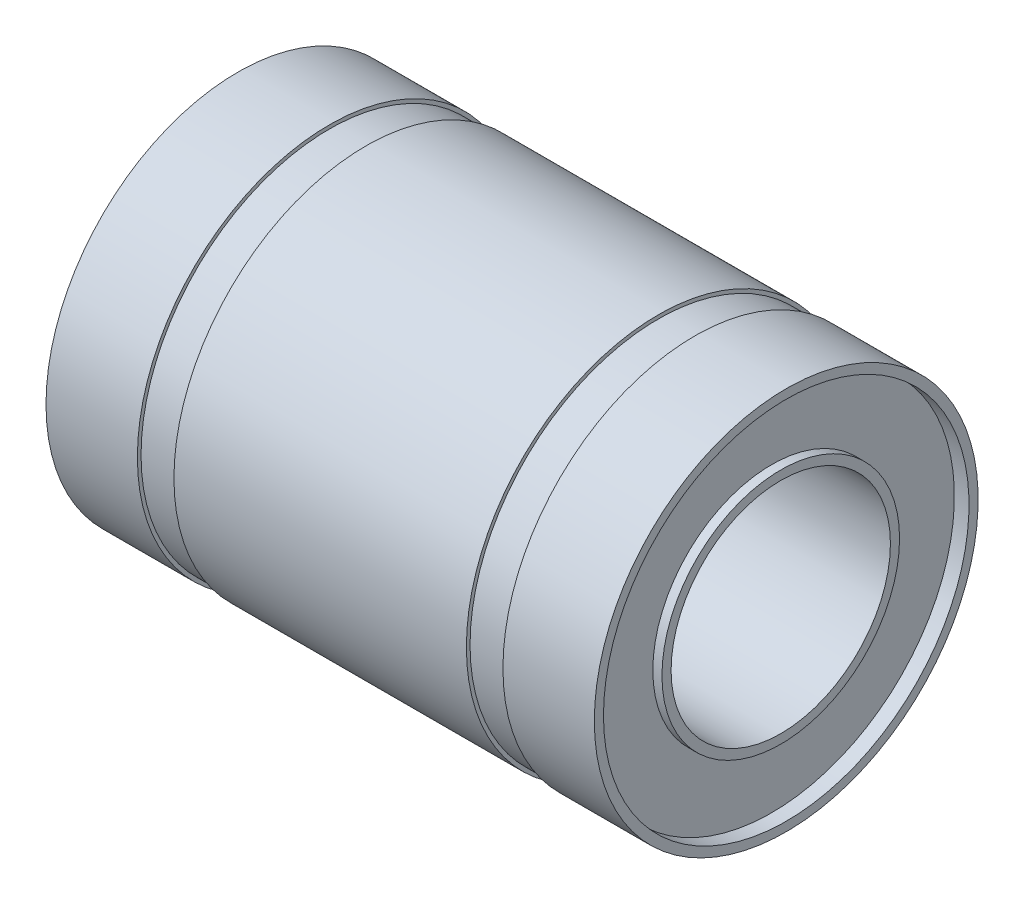
ISO-10303-21;
HEADER;
FILE_DESCRIPTION(('STEP AP214'),'2;1');
FILE_NAME('part.step','',(''),(''),'','','');
FILE_SCHEMA(('AUTOMOTIVE_DESIGN { 1 0 10303 214 1 1 1 1 }'));
ENDSEC;
DATA;
#1=APPLICATION_CONTEXT('core data for automotive mechanical design processes');
#2=APPLICATION_PROTOCOL_DEFINITION('international standard','automotive_design',2000,#1);
#3=PRODUCT_CONTEXT('',#1,'mechanical');
#4=PRODUCT('Part','Part','',(#3));
#5=PRODUCT_RELATED_PRODUCT_CATEGORY('part','',(#4));
#6=PRODUCT_DEFINITION_FORMATION('','',#4);
#7=PRODUCT_DEFINITION_CONTEXT('part definition',#1,'design');
#8=PRODUCT_DEFINITION('design','',#6,#7);
#9=PRODUCT_DEFINITION_SHAPE('','',#8);
#10=(LENGTH_UNIT() NAMED_UNIT(*) SI_UNIT(.MILLI.,.METRE.));
#11=(NAMED_UNIT(*) PLANE_ANGLE_UNIT() SI_UNIT($,.RADIAN.));
#12=(NAMED_UNIT(*) SI_UNIT($,.STERADIAN.) SOLID_ANGLE_UNIT());
#13=UNCERTAINTY_MEASURE_WITH_UNIT(LENGTH_MEASURE(1.E-05),#10,'distance_accuracy_value','');
#14=(GEOMETRIC_REPRESENTATION_CONTEXT(3) GLOBAL_UNCERTAINTY_ASSIGNED_CONTEXT((#13)) GLOBAL_UNIT_ASSIGNED_CONTEXT((#10,
#11,#12)) REPRESENTATION_CONTEXT('',''));
#15=CARTESIAN_POINT('',(0.,0.,0.));
#16=DIRECTION('',(0.,0.,1.));
#17=DIRECTION('',(1.,0.,0.));
#18=AXIS2_PLACEMENT_3D('',#15,#16,#17);
#19=CARTESIAN_POINT('',(8.00000000000001,10.5,0.));
#20=DIRECTION('',(-1.,0.,0.));
#21=DIRECTION('',(0.,0.,1.));
#22=AXIS2_PLACEMENT_3D('',#19,#20,#21);
#23=PLANE('',#22);
#24=CARTESIAN_POINT('',(8.00000000000001,0.,0.));
#25=DIRECTION('',(-1.,0.,0.));
#26=DIRECTION('',(0.,0.,1.));
#27=AXIS2_PLACEMENT_3D('',#24,#25,#26);
#28=CIRCLE('',#27,10.5);
#29=CARTESIAN_POINT('',(8.00000000000001,0.,10.5));
#30=VERTEX_POINT('',#29);
#31=EDGE_CURVE('E10',#30,#30,#28,.T.);
#32=ORIENTED_EDGE('',*,*,#31,.F.);
#33=EDGE_LOOP('',(#32));
#34=FACE_BOUND('',#33,.T.);
#35=CARTESIAN_POINT('',(8.00000000000001,0.,0.));
#36=DIRECTION('',(-1.,0.,0.));
#37=DIRECTION('',(0.,0.,1.));
#38=AXIS2_PLACEMENT_3D('',#35,#36,#37);
#39=CIRCLE('',#38,10.3);
#40=CARTESIAN_POINT('',(8.00000000000001,0.,10.3));
#41=VERTEX_POINT('',#40);
#42=EDGE_CURVE('E97',#41,#41,#39,.T.);
#43=ORIENTED_EDGE('',*,*,#42,.T.);
#44=EDGE_LOOP('',(#43));
#45=FACE_BOUND('',#44,.T.);
#46=ADVANCED_FACE('F33',(#34,#45),#23,.F.);
#47=CARTESIAN_POINT('',(0.,0.,0.));
#48=DIRECTION('',(-1.,0.,0.));
#49=DIRECTION('',(0.,0.,1.));
#50=AXIS2_PLACEMENT_3D('',#47,#48,#49);
#51=CYLINDRICAL_SURFACE('',#50,10.5);
#52=CARTESIAN_POINT('',(-7.99999999999999,0.,0.));
#53=DIRECTION('',(-1.,0.,0.));
#54=DIRECTION('',(0.,0.,1.));
#55=AXIS2_PLACEMENT_3D('',#52,#53,#54);
#56=CIRCLE('',#55,10.5);
#57=CARTESIAN_POINT('',(-7.99999999999999,0.,10.5));
#58=VERTEX_POINT('',#57);
#59=EDGE_CURVE('E39',#58,#58,#56,.T.);
#60=ORIENTED_EDGE('',*,*,#59,.F.);
#61=EDGE_LOOP('',(#60));
#62=FACE_BOUND('',#61,.T.);
#63=ORIENTED_EDGE('',*,*,#31,.T.);
#64=EDGE_LOOP('',(#63));
#65=FACE_BOUND('',#64,.T.);
#66=ADVANCED_FACE('F206',(#62,#65),#51,.T.);
#67=CARTESIAN_POINT('',(-7.99999999999999,10.5,0.));
#68=DIRECTION('',(1.,0.,0.));
#69=DIRECTION('',(0.,0.,-1.));
#70=AXIS2_PLACEMENT_3D('',#67,#68,#69);
#71=PLANE('',#70);
#72=CARTESIAN_POINT('',(-7.99999999999999,0.,0.));
#73=DIRECTION('',(-1.,0.,0.));
#74=DIRECTION('',(0.,0.,1.));
#75=AXIS2_PLACEMENT_3D('',#72,#73,#74);
#76=CIRCLE('',#75,10.3);
#77=CARTESIAN_POINT('',(-7.99999999999999,0.,10.3));
#78=VERTEX_POINT('',#77);
#79=EDGE_CURVE('E43',#78,#78,#76,.T.);
#80=ORIENTED_EDGE('',*,*,#79,.F.);
#81=EDGE_LOOP('',(#80));
#82=FACE_BOUND('',#81,.T.);
#83=ORIENTED_EDGE('',*,*,#59,.T.);
#84=EDGE_LOOP('',(#83));
#85=FACE_BOUND('',#84,.T.);
#86=ADVANCED_FACE('F201',(#82,#85),#71,.F.);
#87=CARTESIAN_POINT('',(0.,0.,0.));
#88=DIRECTION('',(-1.,0.,0.));
#89=DIRECTION('',(0.,0.,1.));
#90=AXIS2_PLACEMENT_3D('',#87,#88,#89);
#91=CYLINDRICAL_SURFACE('',#90,10.3);
#92=CARTESIAN_POINT('',(-9.99999999999999,0.,0.));
#93=DIRECTION('',(-1.,0.,0.));
#94=DIRECTION('',(0.,0.,1.));
#95=AXIS2_PLACEMENT_3D('',#92,#93,#94);
#96=CIRCLE('',#95,10.3);
#97=CARTESIAN_POINT('',(-9.99999999999999,0.,10.3));
#98=VERTEX_POINT('',#97);
#99=EDGE_CURVE('E47',#98,#98,#96,.T.);
#100=ORIENTED_EDGE('',*,*,#99,.F.);
#101=EDGE_LOOP('',(#100));
#102=FACE_BOUND('',#101,.T.);
#103=ORIENTED_EDGE('',*,*,#79,.T.);
#104=EDGE_LOOP('',(#103));
#105=FACE_BOUND('',#104,.T.);
#106=ADVANCED_FACE('F195',(#102,#105),#91,.T.);
#107=CARTESIAN_POINT('',(-9.99999999999999,10.3,0.));
#108=DIRECTION('',(-1.,0.,0.));
#109=DIRECTION('',(0.,0.,1.));
#110=AXIS2_PLACEMENT_3D('',#107,#108,#109);
#111=PLANE('',#110);
#112=CARTESIAN_POINT('',(-9.99999999999999,0.,0.));
#113=DIRECTION('',(-1.,0.,0.));
#114=DIRECTION('',(0.,0.,1.));
#115=AXIS2_PLACEMENT_3D('',#112,#113,#114);
#116=CIRCLE('',#115,10.5);
#117=CARTESIAN_POINT('',(-9.99999999999999,0.,10.5));
#118=VERTEX_POINT('',#117);
#119=EDGE_CURVE('E52',#118,#118,#116,.T.);
#120=ORIENTED_EDGE('',*,*,#119,.F.);
#121=EDGE_LOOP('',(#120));
#122=FACE_BOUND('',#121,.T.);
#123=ORIENTED_EDGE('',*,*,#99,.T.);
#124=EDGE_LOOP('',(#123));
#125=FACE_BOUND('',#124,.T.);
#126=ADVANCED_FACE('F189',(#122,#125),#111,.F.);
#127=CARTESIAN_POINT('',(0.,0.,0.));
#128=DIRECTION('',(-1.,0.,0.));
#129=DIRECTION('',(0.,0.,1.));
#130=AXIS2_PLACEMENT_3D('',#127,#128,#129);
#131=CYLINDRICAL_SURFACE('',#130,10.5);
#132=CARTESIAN_POINT('',(-15.,0.,0.));
#133=DIRECTION('',(-1.,0.,0.));
#134=DIRECTION('',(0.,0.,1.));
#135=AXIS2_PLACEMENT_3D('',#132,#133,#134);
#136=CIRCLE('',#135,10.5);
#137=CARTESIAN_POINT('',(-15.,0.,10.5));
#138=VERTEX_POINT('',#137);
#139=EDGE_CURVE('E55',#138,#138,#136,.T.);
#140=ORIENTED_EDGE('',*,*,#139,.F.);
#141=EDGE_LOOP('',(#140));
#142=FACE_BOUND('',#141,.T.);
#143=ORIENTED_EDGE('',*,*,#119,.T.);
#144=EDGE_LOOP('',(#143));
#145=FACE_BOUND('',#144,.T.);
#146=ADVANCED_FACE('F183',(#142,#145),#131,.T.);
#147=CARTESIAN_POINT('',(-15.,10.5,0.));
#148=DIRECTION('',(1.,0.,0.));
#149=DIRECTION('',(0.,0.,-1.));
#150=AXIS2_PLACEMENT_3D('',#147,#148,#149);
#151=PLANE('',#150);
#152=CARTESIAN_POINT('',(-15.,0.,0.));
#153=DIRECTION('',(-1.,0.,0.));
#154=DIRECTION('',(0.,0.,1.));
#155=AXIS2_PLACEMENT_3D('',#152,#153,#154);
#156=CIRCLE('',#155,9.99999999999999);
#157=CARTESIAN_POINT('',(-15.,0.,9.99999999999999));
#158=VERTEX_POINT('',#157);
#159=EDGE_CURVE('E58',#158,#158,#156,.T.);
#160=ORIENTED_EDGE('',*,*,#159,.F.);
#161=EDGE_LOOP('',(#160));
#162=FACE_BOUND('',#161,.T.);
#163=ORIENTED_EDGE('',*,*,#139,.T.);
#164=EDGE_LOOP('',(#163));
#165=FACE_BOUND('',#164,.T.);
#166=ADVANCED_FACE('F177',(#162,#165),#151,.F.);
#167=CARTESIAN_POINT('',(0.,0.,0.));
#168=DIRECTION('',(-1.,0.,0.));
#169=DIRECTION('',(0.,0.,1.));
#170=AXIS2_PLACEMENT_3D('',#167,#168,#169);
#171=CYLINDRICAL_SURFACE('',#170,9.99999999999999);
#172=CARTESIAN_POINT('',(-14.2,0.,0.));
#173=DIRECTION('',(-1.,0.,0.));
#174=DIRECTION('',(0.,0.,1.));
#175=AXIS2_PLACEMENT_3D('',#172,#173,#174);
#176=CIRCLE('',#175,9.99999999999999);
#177=CARTESIAN_POINT('',(-14.2,0.,9.99999999999999));
#178=VERTEX_POINT('',#177);
#179=EDGE_CURVE('E61',#178,#178,#176,.T.);
#180=ORIENTED_EDGE('',*,*,#179,.F.);
#181=EDGE_LOOP('',(#180));
#182=FACE_BOUND('',#181,.T.);
#183=ORIENTED_EDGE('',*,*,#159,.T.);
#184=EDGE_LOOP('',(#183));
#185=FACE_BOUND('',#184,.T.);
#186=ADVANCED_FACE('F171',(#182,#185),#171,.F.);
#187=CARTESIAN_POINT('',(-14.2,9.99999999999999,0.));
#188=DIRECTION('',(1.,0.,0.));
#189=DIRECTION('',(0.,0.,-1.));
#190=AXIS2_PLACEMENT_3D('',#187,#188,#189);
#191=PLANE('',#190);
#192=CARTESIAN_POINT('',(-14.2,0.,0.));
#193=DIRECTION('',(-1.,0.,0.));
#194=DIRECTION('',(0.,0.,1.));
#195=AXIS2_PLACEMENT_3D('',#192,#193,#194);
#196=CIRCLE('',#195,6.49999999999998);
#197=CARTESIAN_POINT('',(-14.2,0.,6.49999999999998));
#198=VERTEX_POINT('',#197);
#199=EDGE_CURVE('E64',#198,#198,#196,.T.);
#200=ORIENTED_EDGE('',*,*,#199,.F.);
#201=EDGE_LOOP('',(#200));
#202=FACE_BOUND('',#201,.T.);
#203=ORIENTED_EDGE('',*,*,#179,.T.);
#204=EDGE_LOOP('',(#203));
#205=FACE_BOUND('',#204,.T.);
#206=ADVANCED_FACE('F165',(#202,#205),#191,.F.);
#207=CARTESIAN_POINT('',(0.,0.,0.));
#208=DIRECTION('',(-1.,0.,0.));
#209=DIRECTION('',(0.,0.,1.));
#210=AXIS2_PLACEMENT_3D('',#207,#208,#209);
#211=CYLINDRICAL_SURFACE('',#210,6.49999999999998);
#212=CARTESIAN_POINT('',(-14.7,0.,0.));
#213=DIRECTION('',(-1.,0.,0.));
#214=DIRECTION('',(0.,0.,1.));
#215=AXIS2_PLACEMENT_3D('',#212,#213,#214);
#216=CIRCLE('',#215,6.49999999999998);
#217=CARTESIAN_POINT('',(-14.7,0.,6.49999999999998));
#218=VERTEX_POINT('',#217);
#219=EDGE_CURVE('E67',#218,#218,#216,.T.);
#220=ORIENTED_EDGE('',*,*,#219,.F.);
#221=EDGE_LOOP('',(#220));
#222=FACE_BOUND('',#221,.T.);
#223=ORIENTED_EDGE('',*,*,#199,.T.);
#224=EDGE_LOOP('',(#223));
#225=FACE_BOUND('',#224,.T.);
#226=ADVANCED_FACE('F159',(#222,#225),#211,.T.);
#227=CARTESIAN_POINT('',(-14.7,6.49999999999998,0.));
#228=DIRECTION('',(1.,0.,0.));
#229=DIRECTION('',(0.,0.,-1.));
#230=AXIS2_PLACEMENT_3D('',#227,#228,#229);
#231=PLANE('',#230);
#232=CARTESIAN_POINT('',(-14.7,0.,0.));
#233=DIRECTION('',(-1.,0.,0.));
#234=DIRECTION('',(0.,0.,1.));
#235=AXIS2_PLACEMENT_3D('',#232,#233,#234);
#236=CIRCLE('',#235,5.99999999999998);
#237=CARTESIAN_POINT('',(-14.7,0.,5.99999999999998));
#238=VERTEX_POINT('',#237);
#239=EDGE_CURVE('E70',#238,#238,#236,.T.);
#240=ORIENTED_EDGE('',*,*,#239,.F.);
#241=EDGE_LOOP('',(#240));
#242=FACE_BOUND('',#241,.T.);
#243=ORIENTED_EDGE('',*,*,#219,.T.);
#244=EDGE_LOOP('',(#243));
#245=FACE_BOUND('',#244,.T.);
#246=ADVANCED_FACE('F153',(#242,#245),#231,.F.);
#247=CARTESIAN_POINT('',(0.,0.,0.));
#248=DIRECTION('',(-1.,0.,0.));
#249=DIRECTION('',(0.,0.,1.));
#250=AXIS2_PLACEMENT_3D('',#247,#248,#249);
#251=CYLINDRICAL_SURFACE('',#250,5.99999999999999);
#252=CARTESIAN_POINT('',(14.7,0.,0.));
#253=DIRECTION('',(-1.,0.,0.));
#254=DIRECTION('',(0.,0.,1.));
#255=AXIS2_PLACEMENT_3D('',#252,#253,#254);
#256=CIRCLE('',#255,5.99999999999999);
#257=CARTESIAN_POINT('',(14.7,0.,5.99999999999999));
#258=VERTEX_POINT('',#257);
#259=EDGE_CURVE('E73',#258,#258,#256,.T.);
#260=ORIENTED_EDGE('',*,*,#259,.F.);
#261=EDGE_LOOP('',(#260));
#262=FACE_BOUND('',#261,.T.);
#263=ORIENTED_EDGE('',*,*,#239,.T.);
#264=EDGE_LOOP('',(#263));
#265=FACE_BOUND('',#264,.T.);
#266=ADVANCED_FACE('F147',(#262,#265),#251,.F.);
#267=CARTESIAN_POINT('',(14.7,6.49999999999999,0.));
#268=DIRECTION('',(-1.,0.,0.));
#269=DIRECTION('',(0.,0.,1.));
#270=AXIS2_PLACEMENT_3D('',#267,#268,#269);
#271=PLANE('',#270);
#272=CARTESIAN_POINT('',(14.7,0.,0.));
#273=DIRECTION('',(-1.,0.,0.));
#274=DIRECTION('',(0.,0.,1.));
#275=AXIS2_PLACEMENT_3D('',#272,#273,#274);
#276=CIRCLE('',#275,6.49999999999999);
#277=CARTESIAN_POINT('',(14.7,0.,6.49999999999999));
#278=VERTEX_POINT('',#277);
#279=EDGE_CURVE('E76',#278,#278,#276,.T.);
#280=ORIENTED_EDGE('',*,*,#279,.F.);
#281=EDGE_LOOP('',(#280));
#282=FACE_BOUND('',#281,.T.);
#283=ORIENTED_EDGE('',*,*,#259,.T.);
#284=EDGE_LOOP('',(#283));
#285=FACE_BOUND('',#284,.T.);
#286=ADVANCED_FACE('F141',(#282,#285),#271,.F.);
#287=CARTESIAN_POINT('',(0.,0.,0.));
#288=DIRECTION('',(-1.,0.,0.));
#289=DIRECTION('',(0.,0.,1.));
#290=AXIS2_PLACEMENT_3D('',#287,#288,#289);
#291=CYLINDRICAL_SURFACE('',#290,6.49999999999999);
#292=CARTESIAN_POINT('',(14.2,0.,0.));
#293=DIRECTION('',(-1.,0.,0.));
#294=DIRECTION('',(0.,0.,1.));
#295=AXIS2_PLACEMENT_3D('',#292,#293,#294);
#296=CIRCLE('',#295,6.49999999999999);
#297=CARTESIAN_POINT('',(14.2,0.,6.49999999999999));
#298=VERTEX_POINT('',#297);
#299=EDGE_CURVE('E79',#298,#298,#296,.T.);
#300=ORIENTED_EDGE('',*,*,#299,.F.);
#301=EDGE_LOOP('',(#300));
#302=FACE_BOUND('',#301,.T.);
#303=ORIENTED_EDGE('',*,*,#279,.T.);
#304=EDGE_LOOP('',(#303));
#305=FACE_BOUND('',#304,.T.);
#306=ADVANCED_FACE('F135',(#302,#305),#291,.T.);
#307=CARTESIAN_POINT('',(14.2,9.99999999999999,0.));
#308=DIRECTION('',(-1.,0.,0.));
#309=DIRECTION('',(0.,0.,1.));
#310=AXIS2_PLACEMENT_3D('',#307,#308,#309);
#311=PLANE('',#310);
#312=CARTESIAN_POINT('',(14.2,0.,0.));
#313=DIRECTION('',(-1.,0.,0.));
#314=DIRECTION('',(0.,0.,1.));
#315=AXIS2_PLACEMENT_3D('',#312,#313,#314);
#316=CIRCLE('',#315,9.99999999999999);
#317=CARTESIAN_POINT('',(14.2,0.,9.99999999999999));
#318=VERTEX_POINT('',#317);
#319=EDGE_CURVE('E82',#318,#318,#316,.T.);
#320=ORIENTED_EDGE('',*,*,#319,.F.);
#321=EDGE_LOOP('',(#320));
#322=FACE_BOUND('',#321,.T.);
#323=ORIENTED_EDGE('',*,*,#299,.T.);
#324=EDGE_LOOP('',(#323));
#325=FACE_BOUND('',#324,.T.);
#326=ADVANCED_FACE('F129',(#322,#325),#311,.F.);
#327=CARTESIAN_POINT('',(0.,0.,0.));
#328=DIRECTION('',(-1.,0.,0.));
#329=DIRECTION('',(0.,0.,1.));
#330=AXIS2_PLACEMENT_3D('',#327,#328,#329);
#331=CYLINDRICAL_SURFACE('',#330,9.99999999999999);
#332=CARTESIAN_POINT('',(15.,0.,0.));
#333=DIRECTION('',(-1.,0.,0.));
#334=DIRECTION('',(0.,0.,1.));
#335=AXIS2_PLACEMENT_3D('',#332,#333,#334);
#336=CIRCLE('',#335,9.99999999999999);
#337=CARTESIAN_POINT('',(15.,0.,9.99999999999999));
#338=VERTEX_POINT('',#337);
#339=EDGE_CURVE('E85',#338,#338,#336,.T.);
#340=ORIENTED_EDGE('',*,*,#339,.F.);
#341=EDGE_LOOP('',(#340));
#342=FACE_BOUND('',#341,.T.);
#343=ORIENTED_EDGE('',*,*,#319,.T.);
#344=EDGE_LOOP('',(#343));
#345=FACE_BOUND('',#344,.T.);
#346=ADVANCED_FACE('F123',(#342,#345),#331,.F.);
#347=CARTESIAN_POINT('',(15.,10.5,0.));
#348=DIRECTION('',(-1.,0.,0.));
#349=DIRECTION('',(0.,0.,1.));
#350=AXIS2_PLACEMENT_3D('',#347,#348,#349);
#351=PLANE('',#350);
#352=CARTESIAN_POINT('',(15.,0.,0.));
#353=DIRECTION('',(-1.,0.,0.));
#354=DIRECTION('',(0.,0.,1.));
#355=AXIS2_PLACEMENT_3D('',#352,#353,#354);
#356=CIRCLE('',#355,10.5);
#357=CARTESIAN_POINT('',(15.,0.,10.5));
#358=VERTEX_POINT('',#357);
#359=EDGE_CURVE('E88',#358,#358,#356,.T.);
#360=ORIENTED_EDGE('',*,*,#359,.F.);
#361=EDGE_LOOP('',(#360));
#362=FACE_BOUND('',#361,.T.);
#363=ORIENTED_EDGE('',*,*,#339,.T.);
#364=EDGE_LOOP('',(#363));
#365=FACE_BOUND('',#364,.T.);
#366=ADVANCED_FACE('F117',(#362,#365),#351,.F.);
#367=CARTESIAN_POINT('',(0.,0.,0.));
#368=DIRECTION('',(-1.,0.,0.));
#369=DIRECTION('',(0.,0.,1.));
#370=AXIS2_PLACEMENT_3D('',#367,#368,#369);
#371=CYLINDRICAL_SURFACE('',#370,10.5);
#372=CARTESIAN_POINT('',(10.,0.,0.));
#373=DIRECTION('',(-1.,0.,0.));
#374=DIRECTION('',(0.,0.,1.));
#375=AXIS2_PLACEMENT_3D('',#372,#373,#374);
#376=CIRCLE('',#375,10.5);
#377=CARTESIAN_POINT('',(10.,0.,10.5));
#378=VERTEX_POINT('',#377);
#379=EDGE_CURVE('E91',#378,#378,#376,.T.);
#380=ORIENTED_EDGE('',*,*,#379,.F.);
#381=EDGE_LOOP('',(#380));
#382=FACE_BOUND('',#381,.T.);
#383=ORIENTED_EDGE('',*,*,#359,.T.);
#384=EDGE_LOOP('',(#383));
#385=FACE_BOUND('',#384,.T.);
#386=ADVANCED_FACE('F111',(#382,#385),#371,.T.);
#387=CARTESIAN_POINT('',(10.,10.3,0.));
#388=DIRECTION('',(1.,0.,0.));
#389=DIRECTION('',(0.,0.,-1.));
#390=AXIS2_PLACEMENT_3D('',#387,#388,#389);
#391=PLANE('',#390);
#392=CARTESIAN_POINT('',(10.,0.,0.));
#393=DIRECTION('',(-1.,0.,0.));
#394=DIRECTION('',(0.,0.,1.));
#395=AXIS2_PLACEMENT_3D('',#392,#393,#394);
#396=CIRCLE('',#395,10.3);
#397=CARTESIAN_POINT('',(10.,0.,10.3));
#398=VERTEX_POINT('',#397);
#399=EDGE_CURVE('E94',#398,#398,#396,.T.);
#400=ORIENTED_EDGE('',*,*,#399,.F.);
#401=EDGE_LOOP('',(#400));
#402=FACE_BOUND('',#401,.T.);
#403=ORIENTED_EDGE('',*,*,#379,.T.);
#404=EDGE_LOOP('',(#403));
#405=FACE_BOUND('',#404,.T.);
#406=ADVANCED_FACE('F105',(#402,#405),#391,.F.);
#407=CARTESIAN_POINT('',(0.,0.,0.));
#408=DIRECTION('',(-1.,0.,0.));
#409=DIRECTION('',(0.,0.,1.));
#410=AXIS2_PLACEMENT_3D('',#407,#408,#409);
#411=CYLINDRICAL_SURFACE('',#410,10.3);
#412=ORIENTED_EDGE('',*,*,#42,.F.);
#413=EDGE_LOOP('',(#412));
#414=FACE_BOUND('',#413,.T.);
#415=ORIENTED_EDGE('',*,*,#399,.T.);
#416=EDGE_LOOP('',(#415));
#417=FACE_BOUND('',#416,.T.);
#418=ADVANCED_FACE('F102',(#414,#417),#411,.T.);
#419=CLOSED_SHELL('',(#46,#66,#86,#106,#126,#146,#166,#186,#206,#226,#246,#266,#286,#306,#326,
#346,#366,#386,#406,#418));
#420=MANIFOLD_SOLID_BREP('B2',#419);
#421=ADVANCED_BREP_SHAPE_REPRESENTATION('',(#18,#420),#14);
#422=SHAPE_DEFINITION_REPRESENTATION(#9,#421);
ENDSEC;
END-ISO-10303-21;
